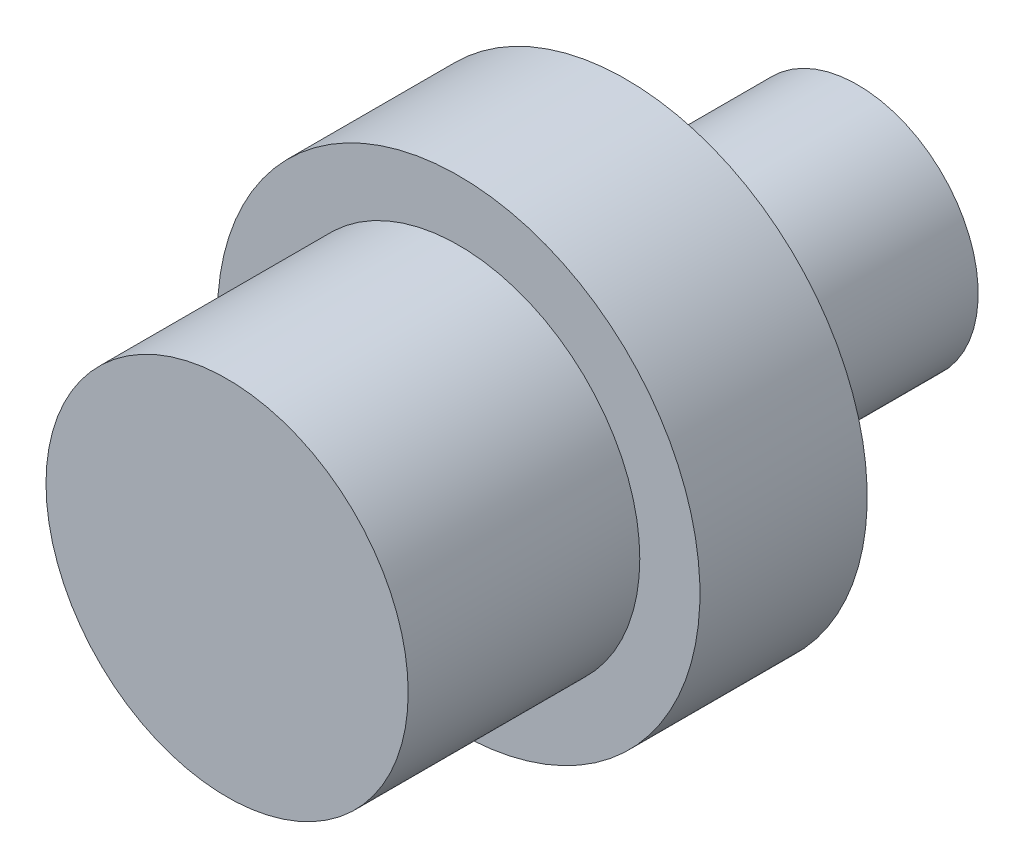
ISO-10303-21;
HEADER;
FILE_DESCRIPTION(('STEP AP214'),'2;1');
FILE_NAME('part.step','',(''),(''),'','','');
FILE_SCHEMA(('AUTOMOTIVE_DESIGN { 1 0 10303 214 1 1 1 1 }'));
ENDSEC;
DATA;
#1=APPLICATION_CONTEXT('core data for automotive mechanical design processes');
#2=APPLICATION_PROTOCOL_DEFINITION('international standard','automotive_design',2000,#1);
#3=PRODUCT_CONTEXT('',#1,'mechanical');
#4=PRODUCT('Part','Part','',(#3));
#5=PRODUCT_RELATED_PRODUCT_CATEGORY('part','',(#4));
#6=PRODUCT_DEFINITION_FORMATION('','',#4);
#7=PRODUCT_DEFINITION_CONTEXT('part definition',#1,'design');
#8=PRODUCT_DEFINITION('design','',#6,#7);
#9=PRODUCT_DEFINITION_SHAPE('','',#8);
#10=(LENGTH_UNIT() NAMED_UNIT(*) SI_UNIT(.MILLI.,.METRE.));
#11=(NAMED_UNIT(*) PLANE_ANGLE_UNIT() SI_UNIT($,.RADIAN.));
#12=(NAMED_UNIT(*) SI_UNIT($,.STERADIAN.) SOLID_ANGLE_UNIT());
#13=UNCERTAINTY_MEASURE_WITH_UNIT(LENGTH_MEASURE(1.E-05),#10,'distance_accuracy_value','');
#14=(GEOMETRIC_REPRESENTATION_CONTEXT(3) GLOBAL_UNCERTAINTY_ASSIGNED_CONTEXT((#13)) GLOBAL_UNIT_ASSIGNED_CONTEXT((#10,
#11,#12)) REPRESENTATION_CONTEXT('',''));
#15=CARTESIAN_POINT('',(0.,0.,0.));
#16=DIRECTION('',(0.,0.,1.));
#17=DIRECTION('',(1.,0.,0.));
#18=AXIS2_PLACEMENT_3D('',#15,#16,#17);
#19=CARTESIAN_POINT('',(0.,0.,-15.748));
#20=DIRECTION('',(0.,0.,-1.));
#21=DIRECTION('',(-1.,0.,0.));
#22=AXIS2_PLACEMENT_3D('',#19,#20,#21);
#23=PLANE('',#22);
#24=CARTESIAN_POINT('',(0.,0.,-15.748));
#25=DIRECTION('',(0.,0.,-1.));
#26=DIRECTION('',(-1.,0.,0.));
#27=AXIS2_PLACEMENT_3D('',#24,#25,#26);
#28=CIRCLE('',#27,4.7625);
#29=CARTESIAN_POINT('',(-4.7625,0.,-15.748));
#30=VERTEX_POINT('',#29);
#31=EDGE_CURVE('E17',#30,#30,#28,.F.);
#32=ORIENTED_EDGE('',*,*,#31,.F.);
#33=EDGE_LOOP('',(#32));
#34=FACE_BOUND('',#33,.T.);
#35=ADVANCED_FACE('F14',(#34),#23,.T.);
#36=CARTESIAN_POINT('',(0.,0.,-6.604));
#37=DIRECTION('',(0.,0.,-1.));
#38=DIRECTION('',(-1.,0.,0.));
#39=AXIS2_PLACEMENT_3D('',#36,#37,#38);
#40=CYLINDRICAL_SURFACE('',#39,4.7625);
#41=CARTESIAN_POINT('',(0.,0.,-6.604));
#42=DIRECTION('',(0.,0.,-1.));
#43=DIRECTION('',(-1.,0.,0.));
#44=AXIS2_PLACEMENT_3D('',#41,#42,#43);
#45=CIRCLE('',#44,4.7625);
#46=CARTESIAN_POINT('',(-4.7625,0.,-6.604));
#47=VERTEX_POINT('',#46);
#48=EDGE_CURVE('E33',#47,#47,#45,.T.);
#49=ORIENTED_EDGE('',*,*,#48,.T.);
#50=EDGE_LOOP('',(#49));
#51=FACE_BOUND('',#50,.T.);
#52=ORIENTED_EDGE('',*,*,#31,.T.);
#53=EDGE_LOOP('',(#52));
#54=FACE_BOUND('',#53,.T.);
#55=ADVANCED_FACE('F40',(#51,#54),#40,.T.);
#56=CARTESIAN_POINT('',(0.,0.,-6.604));
#57=DIRECTION('',(0.,0.,1.));
#58=DIRECTION('',(1.,0.,0.));
#59=AXIS2_PLACEMENT_3D('',#56,#57,#58);
#60=PLANE('',#59);
#61=CARTESIAN_POINT('',(0.,0.,-6.604));
#62=DIRECTION('',(0.,0.,-1.));
#63=DIRECTION('',(-1.,0.,0.));
#64=AXIS2_PLACEMENT_3D('',#61,#62,#63);
#65=CIRCLE('',#64,9.525);
#66=CARTESIAN_POINT('',(-9.525,0.,-6.604));
#67=VERTEX_POINT('',#66);
#68=EDGE_CURVE('E31',#67,#67,#65,.F.);
#69=ORIENTED_EDGE('',*,*,#68,.F.);
#70=EDGE_LOOP('',(#69));
#71=FACE_BOUND('',#70,.T.);
#72=ORIENTED_EDGE('',*,*,#48,.F.);
#73=EDGE_LOOP('',(#72));
#74=FACE_BOUND('',#73,.T.);
#75=ADVANCED_FACE('F47',(#71,#74),#60,.F.);
#76=CARTESIAN_POINT('',(0.,0.,0.));
#77=DIRECTION('',(0.,0.,-1.));
#78=DIRECTION('',(-1.,0.,0.));
#79=AXIS2_PLACEMENT_3D('',#76,#77,#78);
#80=CYLINDRICAL_SURFACE('',#79,9.525);
#81=CARTESIAN_POINT('',(0.,0.,0.));
#82=DIRECTION('',(0.,0.,-1.));
#83=DIRECTION('',(-1.,0.,0.));
#84=AXIS2_PLACEMENT_3D('',#81,#82,#83);
#85=CIRCLE('',#84,9.525);
#86=CARTESIAN_POINT('',(-9.525,0.,0.));
#87=VERTEX_POINT('',#86);
#88=EDGE_CURVE('E26',#87,#87,#85,.F.);
#89=ORIENTED_EDGE('',*,*,#88,.F.);
#90=EDGE_LOOP('',(#89));
#91=FACE_BOUND('',#90,.T.);
#92=ORIENTED_EDGE('',*,*,#68,.T.);
#93=EDGE_LOOP('',(#92));
#94=FACE_BOUND('',#93,.T.);
#95=ADVANCED_FACE('F62',(#91,#94),#80,.T.);
#96=CARTESIAN_POINT('',(0.,0.,9.144));
#97=DIRECTION('',(0.,0.,1.));
#98=DIRECTION('',(1.,0.,0.));
#99=AXIS2_PLACEMENT_3D('',#96,#97,#98);
#100=PLANE('',#99);
#101=CARTESIAN_POINT('',(0.,0.,9.144));
#102=DIRECTION('',(0.,0.,1.));
#103=DIRECTION('',(1.,0.,0.));
#104=AXIS2_PLACEMENT_3D('',#101,#102,#103);
#105=CIRCLE('',#104,7.1501);
#106=CARTESIAN_POINT('',(7.1501,0.,9.144));
#107=VERTEX_POINT('',#106);
#108=EDGE_CURVE('E21',#107,#107,#105,.F.);
#109=ORIENTED_EDGE('',*,*,#108,.F.);
#110=EDGE_LOOP('',(#109));
#111=FACE_BOUND('',#110,.T.);
#112=ADVANCED_FACE('F55',(#111),#100,.T.);
#113=CARTESIAN_POINT('',(0.,0.,0.));
#114=DIRECTION('',(0.,0.,1.));
#115=DIRECTION('',(1.,0.,0.));
#116=AXIS2_PLACEMENT_3D('',#113,#114,#115);
#117=PLANE('',#116);
#118=CARTESIAN_POINT('',(0.,0.,0.));
#119=DIRECTION('',(0.,0.,1.));
#120=DIRECTION('',(1.,0.,0.));
#121=AXIS2_PLACEMENT_3D('',#118,#119,#120);
#122=CIRCLE('',#121,7.1501);
#123=CARTESIAN_POINT('',(7.1501,0.,0.));
#124=VERTEX_POINT('',#123);
#125=EDGE_CURVE('E10',#124,#124,#122,.T.);
#126=ORIENTED_EDGE('',*,*,#125,.F.);
#127=EDGE_LOOP('',(#126));
#128=FACE_BOUND('',#127,.T.);
#129=ORIENTED_EDGE('',*,*,#88,.T.);
#130=EDGE_LOOP('',(#129));
#131=FACE_BOUND('',#130,.T.);
#132=ADVANCED_FACE('F50',(#128,#131),#117,.T.);
#133=CARTESIAN_POINT('',(0.,0.,0.));
#134=DIRECTION('',(0.,0.,1.));
#135=DIRECTION('',(1.,0.,0.));
#136=AXIS2_PLACEMENT_3D('',#133,#134,#135);
#137=CYLINDRICAL_SURFACE('',#136,7.1501);
#138=ORIENTED_EDGE('',*,*,#125,.T.);
#139=EDGE_LOOP('',(#138));
#140=FACE_BOUND('',#139,.T.);
#141=ORIENTED_EDGE('',*,*,#108,.T.);
#142=EDGE_LOOP('',(#141));
#143=FACE_BOUND('',#142,.T.);
#144=ADVANCED_FACE('F48',(#140,#143),#137,.T.);
#145=CLOSED_SHELL('',(#35,#55,#75,#95,#112,#132,#144));
#146=MANIFOLD_SOLID_BREP('B1',#145);
#147=ADVANCED_BREP_SHAPE_REPRESENTATION('',(#18,#146),#14);
#148=SHAPE_DEFINITION_REPRESENTATION(#9,#147);
ENDSEC;
END-ISO-10303-21;
